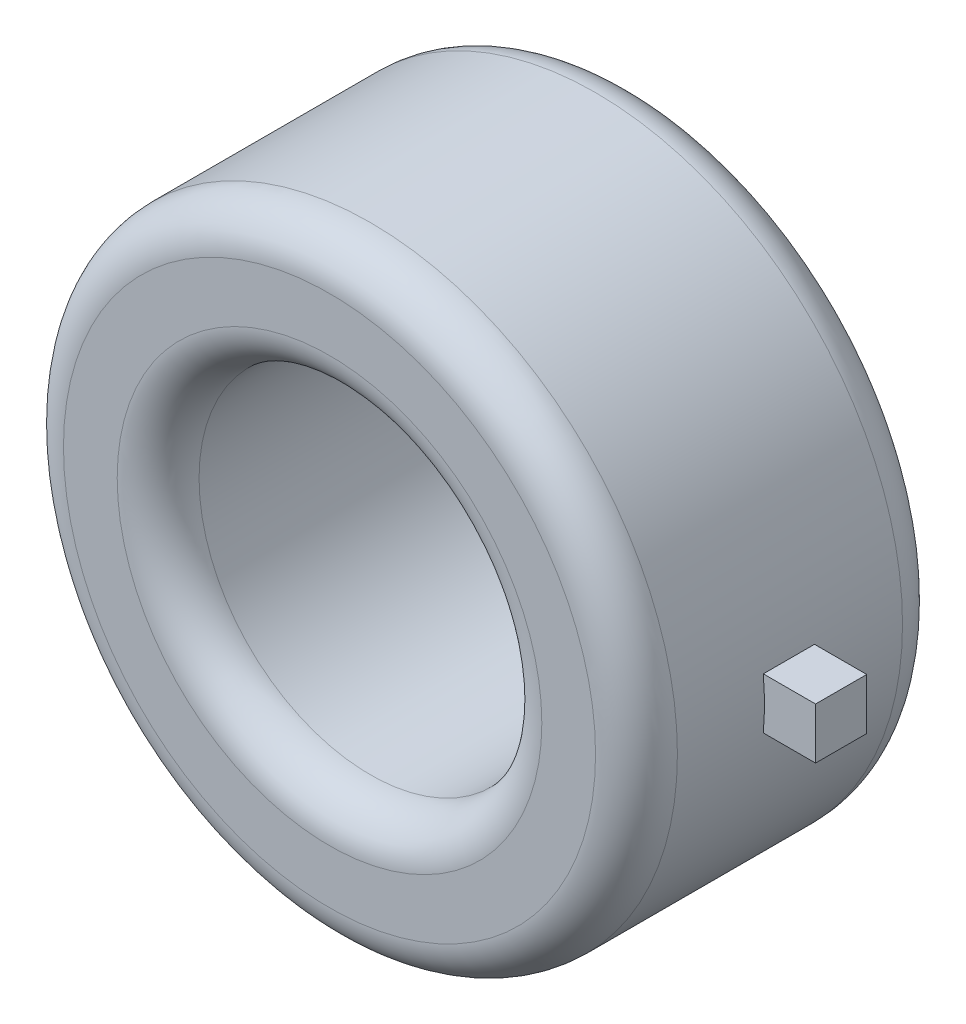
ISO-10303-21;
HEADER;
FILE_DESCRIPTION(('STEP AP214'),'2;1');
FILE_NAME('part.step','',(''),(''),'','','');
FILE_SCHEMA(('AUTOMOTIVE_DESIGN { 1 0 10303 214 1 1 1 1 }'));
ENDSEC;
DATA;
#1=APPLICATION_CONTEXT('core data for automotive mechanical design processes');
#2=APPLICATION_PROTOCOL_DEFINITION('international standard','automotive_design',2000,#1);
#3=PRODUCT_CONTEXT('',#1,'mechanical');
#4=PRODUCT('Part','Part','',(#3));
#5=PRODUCT_RELATED_PRODUCT_CATEGORY('part','',(#4));
#6=PRODUCT_DEFINITION_FORMATION('','',#4);
#7=PRODUCT_DEFINITION_CONTEXT('part definition',#1,'design');
#8=PRODUCT_DEFINITION('design','',#6,#7);
#9=PRODUCT_DEFINITION_SHAPE('','',#8);
#10=(LENGTH_UNIT() NAMED_UNIT(*) SI_UNIT(.MILLI.,.METRE.));
#11=(NAMED_UNIT(*) PLANE_ANGLE_UNIT() SI_UNIT($,.RADIAN.));
#12=(NAMED_UNIT(*) SI_UNIT($,.STERADIAN.) SOLID_ANGLE_UNIT());
#13=UNCERTAINTY_MEASURE_WITH_UNIT(LENGTH_MEASURE(1.E-05),#10,'distance_accuracy_value','');
#14=(GEOMETRIC_REPRESENTATION_CONTEXT(3) GLOBAL_UNCERTAINTY_ASSIGNED_CONTEXT((#13)) GLOBAL_UNIT_ASSIGNED_CONTEXT((#10,
#11,#12)) REPRESENTATION_CONTEXT('',''));
#15=CARTESIAN_POINT('',(0.,0.,0.));
#16=DIRECTION('',(0.,0.,1.));
#17=DIRECTION('',(1.,0.,0.));
#18=AXIS2_PLACEMENT_3D('',#15,#16,#17);
#19=CARTESIAN_POINT('',(0.,0.,2.2));
#20=DIRECTION('',(0.,0.,1.));
#21=DIRECTION('',(1.,0.,0.));
#22=AXIS2_PLACEMENT_3D('',#19,#20,#21);
#23=TOROIDAL_SURFACE('',#22,5.2,0.8);
#24=CARTESIAN_POINT('',(0.,0.,3.));
#25=DIRECTION('',(0.,0.,-1.));
#26=DIRECTION('',(-1.,0.,0.));
#27=AXIS2_PLACEMENT_3D('',#24,#25,#26);
#28=CIRCLE('',#27,5.2);
#29=CARTESIAN_POINT('',(5.2,0.,3.));
#30=VERTEX_POINT('',#29);
#31=CARTESIAN_POINT('',(-5.2,0.,3.));
#32=VERTEX_POINT('',#31);
#33=EDGE_CURVE('E81',#30,#32,#28,.T.);
#34=ORIENTED_EDGE('',*,*,#33,.T.);
#35=CARTESIAN_POINT('',(-5.2,0.,2.2));
#36=DIRECTION('',(0.,-1.,0.));
#37=DIRECTION('',(-1.,0.,0.));
#38=AXIS2_PLACEMENT_3D('',#35,#36,#37);
#39=CIRCLE('',#38,0.8);
#40=CARTESIAN_POINT('',(-6.,0.,2.2));
#41=VERTEX_POINT('',#40);
#42=EDGE_CURVE('E11',#32,#41,#39,.T.);
#43=ORIENTED_EDGE('',*,*,#42,.T.);
#44=CARTESIAN_POINT('',(0.,0.,2.2));
#45=DIRECTION('',(0.,0.,1.));
#46=DIRECTION('',(-1.,0.,0.));
#47=AXIS2_PLACEMENT_3D('',#44,#45,#46);
#48=CIRCLE('',#47,6.);
#49=CARTESIAN_POINT('',(6.,0.,2.2));
#50=VERTEX_POINT('',#49);
#51=EDGE_CURVE('E94',#41,#50,#48,.T.);
#52=ORIENTED_EDGE('',*,*,#51,.T.);
#53=CARTESIAN_POINT('',(0.,0.,2.2));
#54=DIRECTION('',(0.,0.,1.));
#55=DIRECTION('',(-1.,0.,0.));
#56=AXIS2_PLACEMENT_3D('',#53,#54,#55);
#57=CIRCLE('',#56,6.);
#58=EDGE_CURVE('E186',#50,#41,#57,.T.);
#59=ORIENTED_EDGE('',*,*,#58,.T.);
#60=ORIENTED_EDGE('',*,*,#42,.F.);
#61=CARTESIAN_POINT('',(0.,0.,3.));
#62=DIRECTION('',(0.,0.,-1.));
#63=DIRECTION('',(-1.,0.,0.));
#64=AXIS2_PLACEMENT_3D('',#61,#62,#63);
#65=CIRCLE('',#64,5.2);
#66=EDGE_CURVE('E21',#32,#30,#65,.T.);
#67=ORIENTED_EDGE('',*,*,#66,.T.);
#68=EDGE_LOOP('',(#34,#43,#52,#59,#60,#67));
#69=FACE_BOUND('',#68,.T.);
#70=ADVANCED_FACE('F17',(#69),#23,.T.);
#71=CARTESIAN_POINT('',(3.35,0.,3.));
#72=DIRECTION('',(0.,0.,1.));
#73=DIRECTION('',(1.,0.,0.));
#74=AXIS2_PLACEMENT_3D('',#71,#72,#73);
#75=PLANE('',#74);
#76=CARTESIAN_POINT('',(0.,0.,3.));
#77=DIRECTION('',(0.,0.,1.));
#78=DIRECTION('',(-1.,0.,0.));
#79=AXIS2_PLACEMENT_3D('',#76,#77,#78);
#80=CIRCLE('',#79,4.15);
#81=CARTESIAN_POINT('',(4.15,0.,3.));
#82=VERTEX_POINT('',#81);
#83=CARTESIAN_POINT('',(-4.15,0.,3.));
#84=VERTEX_POINT('',#83);
#85=EDGE_CURVE('E69',#82,#84,#80,.T.);
#86=ORIENTED_EDGE('',*,*,#85,.F.);
#87=CARTESIAN_POINT('',(0.,0.,3.));
#88=DIRECTION('',(0.,0.,1.));
#89=DIRECTION('',(-1.,0.,0.));
#90=AXIS2_PLACEMENT_3D('',#87,#88,#89);
#91=CIRCLE('',#90,4.15);
#92=EDGE_CURVE('E78',#84,#82,#91,.T.);
#93=ORIENTED_EDGE('',*,*,#92,.F.);
#94=EDGE_LOOP('',(#86,#93));
#95=FACE_BOUND('',#94,.T.);
#96=ORIENTED_EDGE('',*,*,#33,.F.);
#97=ORIENTED_EDGE('',*,*,#66,.F.);
#98=EDGE_LOOP('',(#96,#97));
#99=FACE_BOUND('',#98,.T.);
#100=ADVANCED_FACE('F19',(#95,#99),#75,.T.);
#101=CARTESIAN_POINT('',(0.,0.,2.2));
#102=DIRECTION('',(0.,0.,1.));
#103=DIRECTION('',(1.,0.,0.));
#104=AXIS2_PLACEMENT_3D('',#101,#102,#103);
#105=TOROIDAL_SURFACE('',#104,4.15,0.8);
#106=CARTESIAN_POINT('',(0.,0.,2.2));
#107=DIRECTION('',(0.,0.,-1.));
#108=DIRECTION('',(-1.,0.,0.));
#109=AXIS2_PLACEMENT_3D('',#106,#107,#108);
#110=CIRCLE('',#109,3.35);
#111=CARTESIAN_POINT('',(3.35,0.,2.2));
#112=VERTEX_POINT('',#111);
#113=CARTESIAN_POINT('',(-3.35,0.,2.2));
#114=VERTEX_POINT('',#113);
#115=EDGE_CURVE('E86',#112,#114,#110,.T.);
#116=ORIENTED_EDGE('',*,*,#115,.T.);
#117=CARTESIAN_POINT('',(-4.15,0.,2.2));
#118=DIRECTION('',(0.,-1.,0.));
#119=DIRECTION('',(-1.,0.,0.));
#120=AXIS2_PLACEMENT_3D('',#117,#118,#119);
#121=CIRCLE('',#120,0.8);
#122=EDGE_CURVE('E76',#114,#84,#121,.T.);
#123=ORIENTED_EDGE('',*,*,#122,.T.);
#124=ORIENTED_EDGE('',*,*,#92,.T.);
#125=ORIENTED_EDGE('',*,*,#85,.T.);
#126=ORIENTED_EDGE('',*,*,#122,.F.);
#127=CARTESIAN_POINT('',(0.,0.,2.2));
#128=DIRECTION('',(0.,0.,-1.));
#129=DIRECTION('',(-1.,0.,0.));
#130=AXIS2_PLACEMENT_3D('',#127,#128,#129);
#131=CIRCLE('',#130,3.35);
#132=EDGE_CURVE('E165',#114,#112,#131,.T.);
#133=ORIENTED_EDGE('',*,*,#132,.T.);
#134=EDGE_LOOP('',(#116,#123,#124,#125,#126,#133));
#135=FACE_BOUND('',#134,.T.);
#136=ADVANCED_FACE('F72',(#135),#105,.T.);
#137=CARTESIAN_POINT('',(0.,0.,0.));
#138=DIRECTION('',(0.,0.,1.));
#139=DIRECTION('',(1.,0.,0.));
#140=AXIS2_PLACEMENT_3D('',#137,#138,#139);
#141=CYLINDRICAL_SURFACE('',#140,6.);
#142=CARTESIAN_POINT('',(0.,0.,-0.5));
#143=DIRECTION('',(0.,0.,-1.));
#144=DIRECTION('',(1.,0.,0.));
#145=AXIS2_PLACEMENT_3D('',#142,#143,#144);
#146=CIRCLE('',#145,6.);
#147=CARTESIAN_POINT('',(5.97913037248527,0.499999988824129,-0.5));
#148=VERTEX_POINT('',#147);
#149=CARTESIAN_POINT('',(5.97913037248527,-0.499999988824129,-0.5));
#150=VERTEX_POINT('',#149);
#151=EDGE_CURVE('E106',#148,#150,#146,.T.);
#152=ORIENTED_EDGE('',*,*,#151,.T.);
#153=DIRECTION('',(0.,0.,1.));
#154=VECTOR('',#153,1.);
#155=CARTESIAN_POINT('',(5.97913037248527,-0.499999988824129,0.));
#156=LINE('',#155,#154);
#157=CARTESIAN_POINT('',(5.97913037248527,-0.499999988824129,0.5));
#158=VERTEX_POINT('',#157);
#159=EDGE_CURVE('E105',#150,#158,#156,.T.);
#160=ORIENTED_EDGE('',*,*,#159,.T.);
#161=CARTESIAN_POINT('',(0.,0.,0.5));
#162=DIRECTION('',(0.,0.,1.));
#163=DIRECTION('',(1.,0.,0.));
#164=AXIS2_PLACEMENT_3D('',#161,#162,#163);
#165=CIRCLE('',#164,6.);
#166=CARTESIAN_POINT('',(5.97913037248527,0.499999988824129,0.5));
#167=VERTEX_POINT('',#166);
#168=EDGE_CURVE('E98',#158,#167,#165,.T.);
#169=ORIENTED_EDGE('',*,*,#168,.T.);
#170=DIRECTION('',(0.,0.,-1.));
#171=VECTOR('',#170,1.);
#172=CARTESIAN_POINT('',(5.97913037248527,0.499999988824129,0.));
#173=LINE('',#172,#171);
#174=EDGE_CURVE('E128',#167,#148,#173,.T.);
#175=ORIENTED_EDGE('',*,*,#174,.T.);
#176=EDGE_LOOP('',(#152,#160,#169,#175));
#177=FACE_BOUND('',#176,.T.);
#178=ORIENTED_EDGE('',*,*,#58,.F.);
#179=ORIENTED_EDGE('',*,*,#51,.F.);
#180=DIRECTION('',(0.,0.,-1.));
#181=VECTOR('',#180,1.);
#182=CARTESIAN_POINT('',(-6.,0.,0.));
#183=LINE('',#182,#181);
#184=CARTESIAN_POINT('',(-6.,0.,-2.2));
#185=VERTEX_POINT('',#184);
#186=EDGE_CURVE('E88',#41,#185,#183,.T.);
#187=ORIENTED_EDGE('',*,*,#186,.T.);
#188=CARTESIAN_POINT('',(0.,0.,-2.2));
#189=DIRECTION('',(0.,0.,-1.));
#190=DIRECTION('',(-1.,0.,0.));
#191=AXIS2_PLACEMENT_3D('',#188,#189,#190);
#192=CIRCLE('',#191,6.);
#193=CARTESIAN_POINT('',(6.,0.,-2.2));
#194=VERTEX_POINT('',#193);
#195=EDGE_CURVE('E174',#194,#185,#192,.T.);
#196=ORIENTED_EDGE('',*,*,#195,.F.);
#197=CARTESIAN_POINT('',(0.,0.,-2.2));
#198=DIRECTION('',(0.,0.,-1.));
#199=DIRECTION('',(-1.,0.,0.));
#200=AXIS2_PLACEMENT_3D('',#197,#198,#199);
#201=CIRCLE('',#200,6.);
#202=EDGE_CURVE('E182',#185,#194,#201,.T.);
#203=ORIENTED_EDGE('',*,*,#202,.F.);
#204=ORIENTED_EDGE('',*,*,#186,.F.);
#205=EDGE_LOOP('',(#178,#179,#187,#196,#203,#204));
#206=FACE_BOUND('',#205,.T.);
#207=ADVANCED_FACE('F196',(#177,#206),#141,.T.);
#208=CARTESIAN_POINT('',(0.,0.,-2.2));
#209=DIRECTION('',(0.,0.,1.));
#210=DIRECTION('',(1.,0.,0.));
#211=AXIS2_PLACEMENT_3D('',#208,#209,#210);
#212=TOROIDAL_SURFACE('',#211,5.2,0.8);
#213=ORIENTED_EDGE('',*,*,#195,.T.);
#214=CARTESIAN_POINT('',(-5.2,0.,-2.2));
#215=DIRECTION('',(0.,-1.,0.));
#216=DIRECTION('',(-1.,0.,0.));
#217=AXIS2_PLACEMENT_3D('',#214,#215,#216);
#218=CIRCLE('',#217,0.8);
#219=CARTESIAN_POINT('',(-5.2,0.,-3.));
#220=VERTEX_POINT('',#219);
#221=EDGE_CURVE('E178',#185,#220,#218,.T.);
#222=ORIENTED_EDGE('',*,*,#221,.T.);
#223=CARTESIAN_POINT('',(0.,0.,-3.));
#224=DIRECTION('',(0.,0.,1.));
#225=DIRECTION('',(-1.,0.,0.));
#226=AXIS2_PLACEMENT_3D('',#223,#224,#225);
#227=CIRCLE('',#226,5.2);
#228=CARTESIAN_POINT('',(5.2,0.,-3.));
#229=VERTEX_POINT('',#228);
#230=EDGE_CURVE('E159',#220,#229,#227,.T.);
#231=ORIENTED_EDGE('',*,*,#230,.T.);
#232=CARTESIAN_POINT('',(0.,0.,-3.));
#233=DIRECTION('',(0.,0.,1.));
#234=DIRECTION('',(-1.,0.,0.));
#235=AXIS2_PLACEMENT_3D('',#232,#233,#234);
#236=CIRCLE('',#235,5.2);
#237=EDGE_CURVE('E155',#229,#220,#236,.T.);
#238=ORIENTED_EDGE('',*,*,#237,.T.);
#239=ORIENTED_EDGE('',*,*,#221,.F.);
#240=ORIENTED_EDGE('',*,*,#202,.T.);
#241=EDGE_LOOP('',(#213,#222,#231,#238,#239,#240));
#242=FACE_BOUND('',#241,.T.);
#243=ADVANCED_FACE('F201',(#242),#212,.T.);
#244=CARTESIAN_POINT('',(0.,0.,0.));
#245=DIRECTION('',(0.,0.,1.));
#246=DIRECTION('',(1.,0.,0.));
#247=AXIS2_PLACEMENT_3D('',#244,#245,#246);
#248=CYLINDRICAL_SURFACE('',#247,3.35);
#249=ORIENTED_EDGE('',*,*,#115,.F.);
#250=ORIENTED_EDGE('',*,*,#132,.F.);
#251=DIRECTION('',(0.,0.,-1.));
#252=VECTOR('',#251,1.);
#253=CARTESIAN_POINT('',(-3.35,0.,0.));
#254=LINE('',#253,#252);
#255=CARTESIAN_POINT('',(-3.35,0.,-2.2));
#256=VERTEX_POINT('',#255);
#257=EDGE_CURVE('E168',#114,#256,#254,.T.);
#258=ORIENTED_EDGE('',*,*,#257,.T.);
#259=CARTESIAN_POINT('',(0.,0.,-2.2));
#260=DIRECTION('',(0.,0.,1.));
#261=DIRECTION('',(-1.,0.,0.));
#262=AXIS2_PLACEMENT_3D('',#259,#260,#261);
#263=CIRCLE('',#262,3.35);
#264=CARTESIAN_POINT('',(3.35,0.,-2.2));
#265=VERTEX_POINT('',#264);
#266=EDGE_CURVE('E125',#265,#256,#263,.T.);
#267=ORIENTED_EDGE('',*,*,#266,.F.);
#268=CARTESIAN_POINT('',(0.,0.,-2.2));
#269=DIRECTION('',(0.,0.,1.));
#270=DIRECTION('',(-1.,0.,0.));
#271=AXIS2_PLACEMENT_3D('',#268,#269,#270);
#272=CIRCLE('',#271,3.35);
#273=EDGE_CURVE('E122',#256,#265,#272,.T.);
#274=ORIENTED_EDGE('',*,*,#273,.F.);
#275=ORIENTED_EDGE('',*,*,#257,.F.);
#276=EDGE_LOOP('',(#249,#250,#258,#267,#274,#275));
#277=FACE_BOUND('',#276,.T.);
#278=ADVANCED_FACE('F242',(#277),#248,.F.);
#279=CARTESIAN_POINT('',(6.,0.,-3.));
#280=DIRECTION('',(0.,0.,-1.));
#281=DIRECTION('',(0.,-1.,0.));
#282=AXIS2_PLACEMENT_3D('',#279,#280,#281);
#283=PLANE('',#282);
#284=CARTESIAN_POINT('',(0.,0.,-3.));
#285=DIRECTION('',(0.,0.,-1.));
#286=DIRECTION('',(-1.,0.,0.));
#287=AXIS2_PLACEMENT_3D('',#284,#285,#286);
#288=CIRCLE('',#287,4.15);
#289=CARTESIAN_POINT('',(4.15,0.,-3.));
#290=VERTEX_POINT('',#289);
#291=CARTESIAN_POINT('',(-4.15,0.,-3.));
#292=VERTEX_POINT('',#291);
#293=EDGE_CURVE('E148',#290,#292,#288,.T.);
#294=ORIENTED_EDGE('',*,*,#293,.F.);
#295=CARTESIAN_POINT('',(0.,0.,-3.));
#296=DIRECTION('',(0.,0.,-1.));
#297=DIRECTION('',(-1.,0.,0.));
#298=AXIS2_PLACEMENT_3D('',#295,#296,#297);
#299=CIRCLE('',#298,4.15);
#300=EDGE_CURVE('E147',#292,#290,#299,.T.);
#301=ORIENTED_EDGE('',*,*,#300,.F.);
#302=EDGE_LOOP('',(#294,#301));
#303=FACE_BOUND('',#302,.T.);
#304=ORIENTED_EDGE('',*,*,#237,.F.);
#305=ORIENTED_EDGE('',*,*,#230,.F.);
#306=EDGE_LOOP('',(#304,#305));
#307=FACE_BOUND('',#306,.T.);
#308=ADVANCED_FACE('F210',(#303,#307),#283,.T.);
#309=CARTESIAN_POINT('',(0.,0.,-2.2));
#310=DIRECTION('',(0.,0.,1.));
#311=DIRECTION('',(1.,0.,0.));
#312=AXIS2_PLACEMENT_3D('',#309,#310,#311);
#313=TOROIDAL_SURFACE('',#312,4.15,0.8);
#314=ORIENTED_EDGE('',*,*,#293,.T.);
#315=CARTESIAN_POINT('',(-4.15,0.,-2.2));
#316=DIRECTION('',(0.,-1.,0.));
#317=DIRECTION('',(-1.,0.,0.));
#318=AXIS2_PLACEMENT_3D('',#315,#316,#317);
#319=CIRCLE('',#318,0.8);
#320=EDGE_CURVE('E126',#292,#256,#319,.T.);
#321=ORIENTED_EDGE('',*,*,#320,.T.);
#322=ORIENTED_EDGE('',*,*,#273,.T.);
#323=ORIENTED_EDGE('',*,*,#266,.T.);
#324=ORIENTED_EDGE('',*,*,#320,.F.);
#325=ORIENTED_EDGE('',*,*,#300,.T.);
#326=EDGE_LOOP('',(#314,#321,#322,#323,#324,#325));
#327=FACE_BOUND('',#326,.T.);
#328=ADVANCED_FACE('F247',(#327),#313,.T.);
#329=CARTESIAN_POINT('',(6.44999985583127,0.,0.5));
#330=DIRECTION('',(0.,0.,1.));
#331=DIRECTION('',(1.,0.,0.));
#332=AXIS2_PLACEMENT_3D('',#329,#330,#331);
#333=PLANE('',#332);
#334=ORIENTED_EDGE('',*,*,#168,.F.);
#335=DIRECTION('',(1.,0.,0.));
#336=VECTOR('',#335,1.);
#337=CARTESIAN_POINT('',(5.89999986812472,-0.499999988824129,0.5));
#338=LINE('',#337,#336);
#339=CARTESIAN_POINT('',(6.99999984353781,-0.499999988824129,0.5));
#340=VERTEX_POINT('',#339);
#341=EDGE_CURVE('E111',#158,#340,#338,.T.);
#342=ORIENTED_EDGE('',*,*,#341,.T.);
#343=DIRECTION('',(0.,1.,0.));
#344=VECTOR('',#343,1.);
#345=CARTESIAN_POINT('',(6.99999984353781,-0.499999988824129,0.5));
#346=LINE('',#345,#344);
#347=CARTESIAN_POINT('',(6.99999984353781,0.499999988824129,0.5));
#348=VERTEX_POINT('',#347);
#349=EDGE_CURVE('E133',#340,#348,#346,.T.);
#350=ORIENTED_EDGE('',*,*,#349,.T.);
#351=DIRECTION('',(-1.,0.,0.));
#352=VECTOR('',#351,1.);
#353=CARTESIAN_POINT('',(6.99999984353781,0.499999988824129,0.5));
#354=LINE('',#353,#352);
#355=EDGE_CURVE('E132',#348,#167,#354,.T.);
#356=ORIENTED_EDGE('',*,*,#355,.T.);
#357=EDGE_LOOP('',(#334,#342,#350,#356));
#358=FACE_BOUND('',#357,.T.);
#359=ADVANCED_FACE('F306',(#358),#333,.T.);
#360=CARTESIAN_POINT('',(6.99999984353781,-0.499999988824129,0.));
#361=DIRECTION('',(1.,0.,0.));
#362=DIRECTION('',(0.,1.,0.));
#363=AXIS2_PLACEMENT_3D('',#360,#361,#362);
#364=PLANE('',#363);
#365=DIRECTION('',(0.,0.,1.));
#366=VECTOR('',#365,1.);
#367=CARTESIAN_POINT('',(6.99999984353781,0.499999988824129,0.));
#368=LINE('',#367,#366);
#369=CARTESIAN_POINT('',(6.99999984353781,0.499999988824129,-0.5));
#370=VERTEX_POINT('',#369);
#371=EDGE_CURVE('E137',#370,#348,#368,.T.);
#372=ORIENTED_EDGE('',*,*,#371,.T.);
#373=ORIENTED_EDGE('',*,*,#349,.F.);
#374=DIRECTION('',(0.,0.,-1.));
#375=VECTOR('',#374,1.);
#376=CARTESIAN_POINT('',(6.99999984353781,-0.499999988824129,0.));
#377=LINE('',#376,#375);
#378=CARTESIAN_POINT('',(6.99999984353781,-0.499999988824129,-0.5));
#379=VERTEX_POINT('',#378);
#380=EDGE_CURVE('E104',#340,#379,#377,.T.);
#381=ORIENTED_EDGE('',*,*,#380,.T.);
#382=DIRECTION('',(0.,-1.,0.));
#383=VECTOR('',#382,1.);
#384=CARTESIAN_POINT('',(6.99999984353781,-0.499999988824129,-0.5));
#385=LINE('',#384,#383);
#386=EDGE_CURVE('E115',#370,#379,#385,.T.);
#387=ORIENTED_EDGE('',*,*,#386,.F.);
#388=EDGE_LOOP('',(#372,#373,#381,#387));
#389=FACE_BOUND('',#388,.T.);
#390=ADVANCED_FACE('F328',(#389),#364,.T.);
#391=CARTESIAN_POINT('',(6.99999984353781,0.499999988824129,0.));
#392=DIRECTION('',(0.,1.,0.));
#393=DIRECTION('',(1.,0.,0.));
#394=AXIS2_PLACEMENT_3D('',#391,#392,#393);
#395=PLANE('',#394);
#396=ORIENTED_EDGE('',*,*,#174,.F.);
#397=ORIENTED_EDGE('',*,*,#355,.F.);
#398=ORIENTED_EDGE('',*,*,#371,.F.);
#399=DIRECTION('',(1.,0.,0.));
#400=VECTOR('',#399,1.);
#401=CARTESIAN_POINT('',(6.99999984353781,0.499999988824129,-0.5));
#402=LINE('',#401,#400);
#403=EDGE_CURVE('E110',#148,#370,#402,.T.);
#404=ORIENTED_EDGE('',*,*,#403,.F.);
#405=EDGE_LOOP('',(#396,#397,#398,#404));
#406=FACE_BOUND('',#405,.T.);
#407=ADVANCED_FACE('F320',(#406),#395,.T.);
#408=CARTESIAN_POINT('',(6.44999985583127,0.,-0.5));
#409=DIRECTION('',(0.,0.,-1.));
#410=DIRECTION('',(0.,-1.,0.));
#411=AXIS2_PLACEMENT_3D('',#408,#409,#410);
#412=PLANE('',#411);
#413=ORIENTED_EDGE('',*,*,#151,.F.);
#414=ORIENTED_EDGE('',*,*,#403,.T.);
#415=ORIENTED_EDGE('',*,*,#386,.T.);
#416=DIRECTION('',(-1.,0.,0.));
#417=VECTOR('',#416,1.);
#418=CARTESIAN_POINT('',(5.89999986812472,-0.499999988824129,-0.5));
#419=LINE('',#418,#417);
#420=EDGE_CURVE('E100',#379,#150,#419,.T.);
#421=ORIENTED_EDGE('',*,*,#420,.T.);
#422=EDGE_LOOP('',(#413,#414,#415,#421));
#423=FACE_BOUND('',#422,.T.);
#424=ADVANCED_FACE('F317',(#423),#412,.T.);
#425=CARTESIAN_POINT('',(5.89999986812472,-0.499999988824129,0.));
#426=DIRECTION('',(0.,-1.,0.));
#427=DIRECTION('',(0.,0.,-1.));
#428=AXIS2_PLACEMENT_3D('',#425,#426,#427);
#429=PLANE('',#428);
#430=ORIENTED_EDGE('',*,*,#159,.F.);
#431=ORIENTED_EDGE('',*,*,#420,.F.);
#432=ORIENTED_EDGE('',*,*,#380,.F.);
#433=ORIENTED_EDGE('',*,*,#341,.F.);
#434=EDGE_LOOP('',(#430,#431,#432,#433));
#435=FACE_BOUND('',#434,.T.);
#436=ADVANCED_FACE('F274',(#435),#429,.T.);
#437=CLOSED_SHELL('',(#70,#100,#136,#207,#243,#278,#308,#328,#359,#390,#407,#424,#436));
#438=MANIFOLD_SOLID_BREP('B1',#437);
#439=ADVANCED_BREP_SHAPE_REPRESENTATION('',(#18,#438),#14);
#440=SHAPE_DEFINITION_REPRESENTATION(#9,#439);
ENDSEC;
END-ISO-10303-21;
